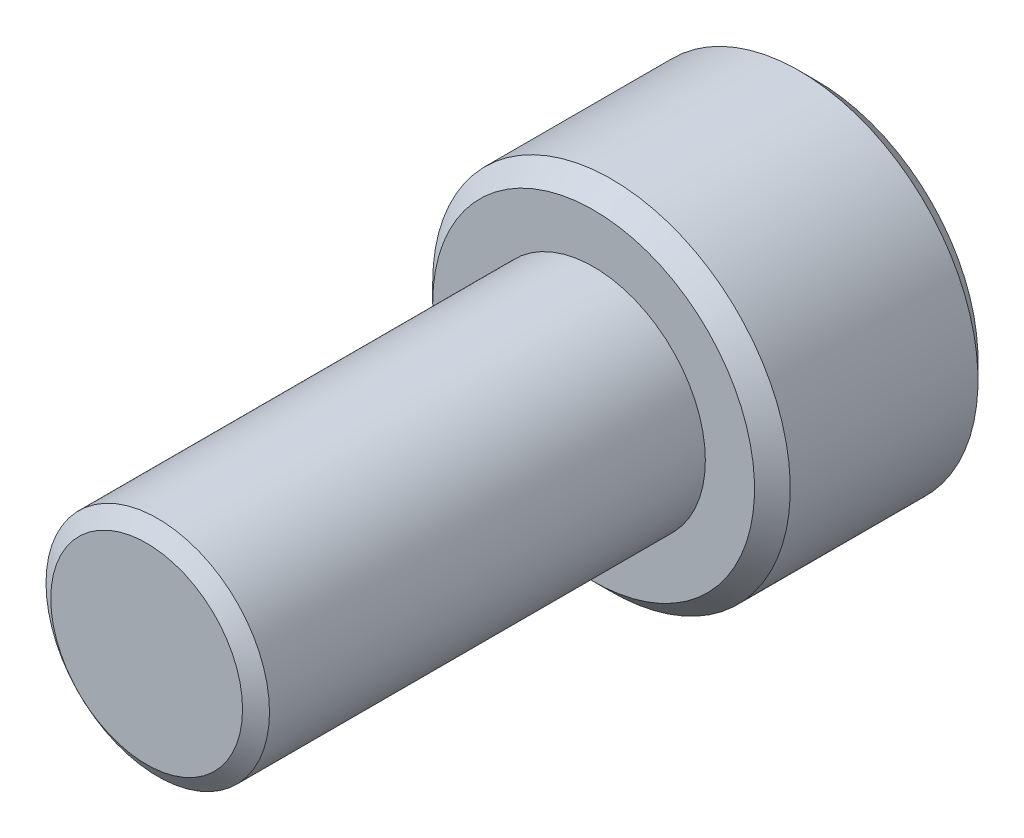
ISO-10303-21;
HEADER;
FILE_DESCRIPTION(('STEP AP214'),'2;1');
FILE_NAME('part.step','',(''),(''),'','','');
FILE_SCHEMA(('AUTOMOTIVE_DESIGN { 1 0 10303 214 1 1 1 1 }'));
ENDSEC;
DATA;
#1=APPLICATION_CONTEXT('core data for automotive mechanical design processes');
#2=APPLICATION_PROTOCOL_DEFINITION('international standard','automotive_design',2000,#1);
#3=PRODUCT_CONTEXT('',#1,'mechanical');
#4=PRODUCT('Part','Part','',(#3));
#5=PRODUCT_RELATED_PRODUCT_CATEGORY('part','',(#4));
#6=PRODUCT_DEFINITION_FORMATION('','',#4);
#7=PRODUCT_DEFINITION_CONTEXT('part definition',#1,'design');
#8=PRODUCT_DEFINITION('design','',#6,#7);
#9=PRODUCT_DEFINITION_SHAPE('','',#8);
#10=(LENGTH_UNIT() NAMED_UNIT(*) SI_UNIT(.MILLI.,.METRE.));
#11=(NAMED_UNIT(*) PLANE_ANGLE_UNIT() SI_UNIT($,.RADIAN.));
#12=(NAMED_UNIT(*) SI_UNIT($,.STERADIAN.) SOLID_ANGLE_UNIT());
#13=UNCERTAINTY_MEASURE_WITH_UNIT(LENGTH_MEASURE(1.E-05),#10,'distance_accuracy_value','');
#14=(GEOMETRIC_REPRESENTATION_CONTEXT(3) GLOBAL_UNCERTAINTY_ASSIGNED_CONTEXT((#13)) GLOBAL_UNIT_ASSIGNED_CONTEXT((#10,
#11,#12)) REPRESENTATION_CONTEXT('',''));
#15=CARTESIAN_POINT('',(0.,0.,0.));
#16=DIRECTION('',(0.,0.,1.));
#17=DIRECTION('',(1.,0.,0.));
#18=AXIS2_PLACEMENT_3D('',#15,#16,#17);
#19=CARTESIAN_POINT('',(0.,0.,-20.));
#20=DIRECTION('',(0.,0.,1.));
#21=DIRECTION('',(1.,0.,0.));
#22=AXIS2_PLACEMENT_3D('',#19,#20,#21);
#23=CYLINDRICAL_SURFACE('',#22,5.);
#24=CARTESIAN_POINT('',(0.,0.,-20.));
#25=DIRECTION('',(0.,0.,-1.));
#26=DIRECTION('',(-1.,0.,0.));
#27=AXIS2_PLACEMENT_3D('',#24,#25,#26);
#28=CIRCLE('',#27,5.);
#29=CARTESIAN_POINT('',(-5.,0.,-20.));
#30=VERTEX_POINT('',#29);
#31=EDGE_CURVE('E230',#30,#30,#28,.F.);
#32=ORIENTED_EDGE('',*,*,#31,.T.);
#33=EDGE_LOOP('',(#32));
#34=FACE_BOUND('',#33,.T.);
#35=CARTESIAN_POINT('',(0.,0.,-0.496211410611025));
#36=DIRECTION('',(0.,0.,1.));
#37=DIRECTION('',(1.,0.,0.));
#38=AXIS2_PLACEMENT_3D('',#35,#36,#37);
#39=CIRCLE('',#38,5.);
#40=CARTESIAN_POINT('',(5.,0.,-0.496211410611025));
#41=VERTEX_POINT('',#40);
#42=EDGE_CURVE('E115',#41,#41,#39,.T.);
#43=ORIENTED_EDGE('',*,*,#42,.F.);
#44=EDGE_LOOP('',(#43));
#45=FACE_BOUND('',#44,.T.);
#46=ADVANCED_FACE('F38',(#34,#45),#23,.T.);
#47=CARTESIAN_POINT('',(0.,0.,0.));
#48=DIRECTION('',(0.,0.,-1.));
#49=DIRECTION('',(-1.,0.,0.));
#50=AXIS2_PLACEMENT_3D('',#47,#48,#49);
#51=CONICAL_SURFACE('',#50,4.29133666301317,0.959931088596885);
#52=ORIENTED_EDGE('',*,*,#42,.T.);
#53=EDGE_LOOP('',(#52));
#54=FACE_BOUND('',#53,.T.);
#55=CARTESIAN_POINT('',(0.,0.,0.));
#56=DIRECTION('',(0.,0.,1.));
#57=DIRECTION('',(1.,0.,0.));
#58=AXIS2_PLACEMENT_3D('',#55,#56,#57);
#59=CIRCLE('',#58,4.29133666301317);
#60=CARTESIAN_POINT('',(4.29133666301317,0.,0.));
#61=VERTEX_POINT('',#60);
#62=EDGE_CURVE('E227',#61,#61,#59,.T.);
#63=ORIENTED_EDGE('',*,*,#62,.F.);
#64=EDGE_LOOP('',(#63));
#65=FACE_BOUND('',#64,.T.);
#66=ADVANCED_FACE('F210',(#54,#65),#51,.T.);
#67=CARTESIAN_POINT('',(0.,0.,0.));
#68=DIRECTION('',(0.,0.,1.));
#69=DIRECTION('',(1.,0.,0.));
#70=AXIS2_PLACEMENT_3D('',#67,#68,#69);
#71=PLANE('',#70);
#72=ORIENTED_EDGE('',*,*,#62,.T.);
#73=EDGE_LOOP('',(#72));
#74=FACE_BOUND('',#73,.T.);
#75=ADVANCED_FACE('F207',(#74),#71,.T.);
#76=CARTESIAN_POINT('',(0.,0.,-30.));
#77=DIRECTION('',(0.,0.,1.));
#78=DIRECTION('',(1.,0.,0.));
#79=AXIS2_PLACEMENT_3D('',#76,#77,#78);
#80=CYLINDRICAL_SURFACE('',#79,8.);
#81=CARTESIAN_POINT('',(0.,0.,-29.2));
#82=DIRECTION('',(0.,0.,-1.));
#83=DIRECTION('',(-1.,0.,0.));
#84=AXIS2_PLACEMENT_3D('',#81,#82,#83);
#85=CIRCLE('',#84,8.);
#86=CARTESIAN_POINT('',(-8.,0.,-29.2));
#87=VERTEX_POINT('',#86);
#88=EDGE_CURVE('E47',#87,#87,#85,.F.);
#89=ORIENTED_EDGE('',*,*,#88,.T.);
#90=EDGE_LOOP('',(#89));
#91=FACE_BOUND('',#90,.T.);
#92=CARTESIAN_POINT('',(0.,0.,-20.8));
#93=DIRECTION('',(0.,0.,-1.));
#94=DIRECTION('',(-1.,0.,0.));
#95=AXIS2_PLACEMENT_3D('',#92,#93,#94);
#96=CIRCLE('',#95,8.);
#97=CARTESIAN_POINT('',(-8.,0.,-20.8));
#98=VERTEX_POINT('',#97);
#99=EDGE_CURVE('E184',#98,#98,#96,.T.);
#100=ORIENTED_EDGE('',*,*,#99,.T.);
#101=EDGE_LOOP('',(#100));
#102=FACE_BOUND('',#101,.T.);
#103=ADVANCED_FACE('F191',(#91,#102),#80,.T.);
#104=CARTESIAN_POINT('',(0.,0.,-30.));
#105=DIRECTION('',(0.,0.,-1.));
#106=DIRECTION('',(-1.,0.,0.));
#107=AXIS2_PLACEMENT_3D('',#104,#105,#106);
#108=PLANE('',#107);
#109=CARTESIAN_POINT('',(0.,0.,-30.));
#110=DIRECTION('',(0.,0.,-1.));
#111=DIRECTION('',(-1.,0.,0.));
#112=AXIS2_PLACEMENT_3D('',#109,#110,#111);
#113=CIRCLE('',#112,7.2);
#114=CARTESIAN_POINT('',(-7.2,0.,-30.));
#115=VERTEX_POINT('',#114);
#116=EDGE_CURVE('E114',#115,#115,#113,.T.);
#117=ORIENTED_EDGE('',*,*,#116,.T.);
#118=EDGE_LOOP('',(#117));
#119=FACE_BOUND('',#118,.T.);
#120=CARTESIAN_POINT('',(0.,0.,-30.));
#121=DIRECTION('',(0.,0.,-1.));
#122=DIRECTION('',(-1.,0.,0.));
#123=AXIS2_PLACEMENT_3D('',#120,#121,#122);
#124=CIRCLE('',#123,4.618802153517);
#125=CARTESIAN_POINT('',(-4.,2.3094010767585,-30.));
#126=VERTEX_POINT('',#125);
#127=CARTESIAN_POINT('',(0.,4.618802153517,-30.));
#128=VERTEX_POINT('',#127);
#129=EDGE_CURVE('E93',#126,#128,#124,.T.);
#130=ORIENTED_EDGE('',*,*,#129,.F.);
#131=CARTESIAN_POINT('',(-4.,-2.3094010767585,-30.));
#132=VERTEX_POINT('',#131);
#133=EDGE_CURVE('E53',#132,#126,#124,.T.);
#134=ORIENTED_EDGE('',*,*,#133,.F.);
#135=CARTESIAN_POINT('',(0.,-4.61880215351701,-30.));
#136=VERTEX_POINT('',#135);
#137=EDGE_CURVE('E303',#136,#132,#124,.T.);
#138=ORIENTED_EDGE('',*,*,#137,.F.);
#139=CARTESIAN_POINT('',(4.,-2.3094010767585,-30.));
#140=VERTEX_POINT('',#139);
#141=EDGE_CURVE('E60',#140,#136,#124,.T.);
#142=ORIENTED_EDGE('',*,*,#141,.F.);
#143=CARTESIAN_POINT('',(4.,2.3094010767585,-30.));
#144=VERTEX_POINT('',#143);
#145=EDGE_CURVE('E138',#144,#140,#124,.T.);
#146=ORIENTED_EDGE('',*,*,#145,.F.);
#147=EDGE_CURVE('E103',#128,#144,#124,.T.);
#148=ORIENTED_EDGE('',*,*,#147,.F.);
#149=EDGE_LOOP('',(#130,#134,#138,#142,#146,#148));
#150=FACE_BOUND('',#149,.T.);
#151=ADVANCED_FACE('F137',(#119,#150),#108,.T.);
#152=CARTESIAN_POINT('',(0.,0.,-20.));
#153=DIRECTION('',(0.,0.,-1.));
#154=DIRECTION('',(-1.,0.,0.));
#155=AXIS2_PLACEMENT_3D('',#152,#153,#154);
#156=PLANE('',#155);
#157=CARTESIAN_POINT('',(0.,0.,-20.));
#158=DIRECTION('',(0.,0.,-1.));
#159=DIRECTION('',(-1.,0.,0.));
#160=AXIS2_PLACEMENT_3D('',#157,#158,#159);
#161=CIRCLE('',#160,7.2);
#162=CARTESIAN_POINT('',(-7.2,0.,-20.));
#163=VERTEX_POINT('',#162);
#164=EDGE_CURVE('E11',#163,#163,#161,.F.);
#165=ORIENTED_EDGE('',*,*,#164,.T.);
#166=EDGE_LOOP('',(#165));
#167=FACE_BOUND('',#166,.T.);
#168=ORIENTED_EDGE('',*,*,#31,.F.);
#169=EDGE_LOOP('',(#168));
#170=FACE_BOUND('',#169,.T.);
#171=ADVANCED_FACE('F200',(#167,#170),#156,.F.);
#172=CARTESIAN_POINT('',(0.,0.,-30.));
#173=DIRECTION('',(0.,0.,-1.));
#174=DIRECTION('',(-1.,0.,0.));
#175=AXIS2_PLACEMENT_3D('',#172,#173,#174);
#176=CONICAL_SURFACE('',#175,4.618802153517,0.78539816339745);
#177=ORIENTED_EDGE('',*,*,#147,.T.);
#178=CARTESIAN_POINT('',(-0.000199999999999718,4.61891762357084,-30.0001154743839));
#179=CARTESIAN_POINT('',(0.0685809847183837,4.57920690352856,-29.9604088559576));
#180=CARTESIAN_POINT('',(0.137888304896502,4.53919230356691,-29.9219204171131));
#181=CARTESIAN_POINT('',(0.277664036763594,4.45849274714727,-29.8477512237355));
#182=CARTESIAN_POINT('',(0.348133057578705,4.41780743901013,-29.8120720027316));
#183=CARTESIAN_POINT('',(0.562100081603904,4.29427352009148,-29.709500867651));
#184=CARTESIAN_POINT('',(0.707416589267747,4.21037499527406,-29.6475131110126));
#185=CARTESIAN_POINT('',(1.00040214981326,4.04121970302444,-29.5413558690094));
#186=CARTESIAN_POINT('',(1.14799719663765,3.95600566300932,-29.4969190554534));
#187=CARTESIAN_POINT('',(1.44644641508887,3.78369592639708,-29.4284489821294));
#188=CARTESIAN_POINT('',(1.59729144640344,3.69660550696169,-29.4043646378613));
#189=CARTESIAN_POINT('',(1.85726690511356,3.54650860589271,-29.3826348808605));
#190=CARTESIAN_POINT('',(1.96606238220553,3.48369550790705,-29.3794189146409));
#191=CARTESIAN_POINT('',(2.18347675426333,3.35817126167378,-29.384840058225));
#192=CARTESIAN_POINT('',(2.29209557396636,3.29546015687918,-29.3934813231718));
#193=CARTESIAN_POINT('',(2.50830402737816,3.1706321481008,-29.4221240384964));
#194=CARTESIAN_POINT('',(2.61589237292034,3.10851598784036,-29.4421381945513));
#195=CARTESIAN_POINT('',(2.82922129322135,2.98535047827864,-29.4924341573647));
#196=CARTESIAN_POINT('',(2.93496200899965,2.92430104755974,-29.5227151768784));
#197=CARTESIAN_POINT('',(3.12267722089176,2.81592361944283,-29.5850152526942));
#198=CARTESIAN_POINT('',(3.20506731843131,2.76835567444982,-29.6153962798601));
#199=CARTESIAN_POINT('',(3.3683684620413,2.67407371522762,-29.6810544645603));
#200=CARTESIAN_POINT('',(3.44927946303276,2.62735972702479,-29.7163317710398));
#201=CARTESIAN_POINT('',(3.60936749601013,2.53493285809127,-29.7909916870209));
#202=CARTESIAN_POINT('',(3.68854908118624,2.48921734857499,-29.8303613870036));
#203=CARTESIAN_POINT('',(3.84544590098815,2.39863292742735,-29.9126891081433));
#204=CARTESIAN_POINT('',(3.92316199986076,2.35376351682288,-29.9556449278019));
#205=CARTESIAN_POINT('',(4.0002,2.30928560670467,-30.0001154743839));
#206=B_SPLINE_CURVE_WITH_KNOTS('',3,(#178,#179,#180,#181,#182,#183,#184,#185,#186,#187,#188,
#189,#190,#191,#192,#193,#194,#195,#196,#197,#198,#199,#200,#201,#202,#203,#204,#205),
.UNSPECIFIED.,.F.,.F.,(4,2,2,2,2,2,2,2,2,2,2,2,2,4),(0.,0.266361961703663,0.532868334400111,
1.06875865685462,1.59613884594051,2.1221913505558,2.49866160599658,2.87526382203494,
3.25228760372076,3.62928248242857,3.92874944437161,4.22822551811345,4.52678401907573,
4.82516056577921),.UNSPECIFIED.);
#207=EDGE_CURVE('E108',#128,#144,#206,.T.);
#208=ORIENTED_EDGE('',*,*,#207,.F.);
#209=EDGE_LOOP('',(#177,#208));
#210=FACE_BOUND('',#209,.T.);
#211=ADVANCED_FACE('F109',(#210),#176,.F.);
#212=ORIENTED_EDGE('',*,*,#145,.T.);
#213=CARTESIAN_POINT('',(4.,-4.60588834585846,-31.4815427100554));
#214=CARTESIAN_POINT('',(4.,-4.49374002821923,-31.3968876312289));
#215=CARTESIAN_POINT('',(4.,-4.38096379821011,-31.3130508557852));
#216=CARTESIAN_POINT('',(4.,-4.1539078224607,-31.1473802935294));
#217=CARTESIAN_POINT('',(4.,-4.03962770639667,-31.0655470148149));
#218=CARTESIAN_POINT('',(4.,-3.80848031083369,-30.9036679969616));
#219=CARTESIAN_POINT('',(4.,-3.69159984616663,-30.8236410211269));
#220=CARTESIAN_POINT('',(4.,-3.45585499794049,-30.6665741495931));
#221=CARTESIAN_POINT('',(4.,-3.33699075539683,-30.5895340428573));
#222=CARTESIAN_POINT('',(4.,-3.09010281107529,-30.4348060364959));
#223=CARTESIAN_POINT('',(4.,-2.96194389824947,-30.3573327874458));
#224=CARTESIAN_POINT('',(4.,-2.70263458682281,-30.207483494942));
#225=CARTESIAN_POINT('',(4.,-2.57148371860612,-30.1351082590594));
#226=CARTESIAN_POINT('',(4.,-2.30620269588561,-29.9970165999514));
#227=CARTESIAN_POINT('',(4.,-2.1720828143263,-29.931280596426));
#228=CARTESIAN_POINT('',(4.,-1.90018524463694,-29.8079389856064));
#229=CARTESIAN_POINT('',(4.,-1.76240924651062,-29.750329696999));
#230=CARTESIAN_POINT('',(4.,-1.49423245423071,-29.6495195910183));
#231=CARTESIAN_POINT('',(4.,-1.36413038006124,-29.6055323527125));
#232=CARTESIAN_POINT('',(4.,-1.10079389466481,-29.5279953825842));
#233=CARTESIAN_POINT('',(4.,-0.967559268328321,-29.49444636981));
#234=CARTESIAN_POINT('',(4.,-0.700969263713321,-29.4400959937613));
#235=CARTESIAN_POINT('',(4.,-0.567659151489366,-29.4190762199428));
#236=CARTESIAN_POINT('',(4.,-0.299613801548666,-29.3901923046075));
#237=CARTESIAN_POINT('',(4.,-0.164878812816916,-29.3823259016629));
#238=CARTESIAN_POINT('',(4.,0.0998110426161468,-29.3803329421123));
#239=CARTESIAN_POINT('',(4.,0.229762408781349,-29.3857193675581));
#240=CARTESIAN_POINT('',(4.,0.488552004486205,-29.4088600629805));
#241=CARTESIAN_POINT('',(4.,0.617390124658868,-29.4266155344344));
#242=CARTESIAN_POINT('',(4.,0.875199003234475,-29.4738276474748));
#243=CARTESIAN_POINT('',(4.,1.00413270849071,-29.5034834133105));
#244=CARTESIAN_POINT('',(4.,1.25919079381534,-29.5729145209428));
#245=CARTESIAN_POINT('',(4.,1.38531540799082,-29.6126890159958));
#246=CARTESIAN_POINT('',(4.,1.64617719318931,-29.7048119901029));
#247=CARTESIAN_POINT('',(4.,1.78061927932313,-29.7579876430135));
#248=CARTESIAN_POINT('',(4.,2.046011294482,-29.8725026332475));
#249=CARTESIAN_POINT('',(4.,2.17695956238624,-29.9338457735747));
#250=CARTESIAN_POINT('',(4.,2.4360038929671,-30.0632362545334));
#251=CARTESIAN_POINT('',(4.,2.5640893557596,-30.1313046457109));
#252=CARTESIAN_POINT('',(4.,2.81731270115426,-30.2726411351195));
#253=CARTESIAN_POINT('',(4.,2.94245104834804,-30.345908406377));
#254=CARTESIAN_POINT('',(4.,3.18400809183147,-30.4928694369693));
#255=CARTESIAN_POINT('',(4.,3.30055078216151,-30.5663604651561));
#256=CARTESIAN_POINT('',(4.,3.5316354061622,-30.7164329441833));
#257=CARTESIAN_POINT('',(4.,3.64617718734198,-30.7930146291055));
#258=CARTESIAN_POINT('',(4.,3.87259303922058,-30.9480834223493));
#259=CARTESIAN_POINT('',(4.,3.98448122200407,-31.0265499994366));
#260=CARTESIAN_POINT('',(4.,4.20672850859699,-31.1855582141516));
#261=CARTESIAN_POINT('',(4.,4.31708802443965,-31.2660992752063));
#262=CARTESIAN_POINT('',(4.,4.42680741385317,-31.3474884762919));
#263=B_SPLINE_CURVE_WITH_KNOTS('',3,(#213,#214,#215,#216,#217,#218,#219,#220,#221,#222,#223,
#224,#225,#226,#227,#228,#229,#230,#231,#232,#233,#234,#235,#236,#237,#238,#239,#240,#241,#242,
#243,#244,#245,#246,#247,#248,#249,#250,#251,#252,#253,#254,#255,#256,#257,#258,#259,#260,#261,
#262),.UNSPECIFIED.,.F.,.F.,(4,2,2,2,2,2,2,2,2,2,2,2,2,2,2,2,2,2,2,2,2,2,2,2,4),(0.,
0.421545463953782,0.84319674931718,1.26811510924698,1.69300339174034,2.14217661823513,
2.59142083852277,3.03929889601296,3.48697341360786,3.8986221993791,4.31029933574147,
4.71457260722766,5.11877636581776,5.50834966824608,5.89796081747125,6.29438282622667,
6.69077167296899,7.12416312979248,7.55775709580142,7.99275404267762,8.42768195006618,
8.84096248534662,9.2542743808521,9.66422889385948,10.0740706699154),.UNSPECIFIED.);
#264=EDGE_CURVE('E102',#144,#140,#263,.F.);
#265=ORIENTED_EDGE('',*,*,#264,.F.);
#266=EDGE_LOOP('',(#212,#265));
#267=FACE_BOUND('',#266,.T.);
#268=ADVANCED_FACE('F314',(#267),#176,.F.);
#269=ORIENTED_EDGE('',*,*,#141,.T.);
#270=CARTESIAN_POINT('',(4.0002,-2.30928560670467,-30.0001154743839));
#271=CARTESIAN_POINT('',(3.93141901528162,-2.34899632674695,-29.9604088559576));
#272=CARTESIAN_POINT('',(3.8621116951035,-2.3890109267086,-29.9219204171131));
#273=CARTESIAN_POINT('',(3.72233596323641,-2.46971048312824,-29.8477512237355));
#274=CARTESIAN_POINT('',(3.65186694242129,-2.51039579126538,-29.8120720027316));
#275=CARTESIAN_POINT('',(3.4378999183961,-2.63392971018403,-29.709500867651));
#276=CARTESIAN_POINT('',(3.29258341073225,-2.71782823500144,-29.6475131110126));
#277=CARTESIAN_POINT('',(2.99959785018675,-2.88698352725107,-29.5413558690094));
#278=CARTESIAN_POINT('',(2.85200280336236,-2.97219756726618,-29.4969190554534));
#279=CARTESIAN_POINT('',(2.55355358491113,-3.14450730387843,-29.4284489821294));
#280=CARTESIAN_POINT('',(2.40270855359656,-3.23159772331381,-29.4043646378613));
#281=CARTESIAN_POINT('',(2.14273309488644,-3.3816946243828,-29.3826348808605));
#282=CARTESIAN_POINT('',(2.03393761779447,-3.44450772236846,-29.3794189146409));
#283=CARTESIAN_POINT('',(1.81652324573667,-3.57003196860173,-29.384840058225));
#284=CARTESIAN_POINT('',(1.70790442603364,-3.63274307339633,-29.3934813231718));
#285=CARTESIAN_POINT('',(1.49169597262184,-3.7575710821747,-29.4221240384964));
#286=CARTESIAN_POINT('',(1.38410762707967,-3.81968724243515,-29.4421381945513));
#287=CARTESIAN_POINT('',(1.17077870677865,-3.94285275199687,-29.4924341573647));
#288=CARTESIAN_POINT('',(1.06503799100036,-4.00390218271577,-29.5227151768784));
#289=CARTESIAN_POINT('',(0.877322779108238,-4.11227961083267,-29.5850152526942));
#290=CARTESIAN_POINT('',(0.79493268156869,-4.15984755582569,-29.6153962798601));
#291=CARTESIAN_POINT('',(0.631631537958706,-4.25412951504789,-29.6810544645603));
#292=CARTESIAN_POINT('',(0.550720536967238,-4.30084350325072,-29.7163317710398));
#293=CARTESIAN_POINT('',(0.390632503989867,-4.39327037218424,-29.7909916870209));
#294=CARTESIAN_POINT('',(0.311450918813762,-4.43898588170052,-29.8303613870036));
#295=CARTESIAN_POINT('',(0.154554099011845,-4.52957030284816,-29.9126891081433));
#296=CARTESIAN_POINT('',(0.0768380001392352,-4.57443971345263,-29.9556449278019));
#297=CARTESIAN_POINT('',(-0.000199999999999255,-4.61891762357084,-30.0001154743839));
#298=B_SPLINE_CURVE_WITH_KNOTS('',3,(#270,#271,#272,#273,#274,#275,#276,#277,#278,#279,#280,
#281,#282,#283,#284,#285,#286,#287,#288,#289,#290,#291,#292,#293,#294,#295,#296,#297),
.UNSPECIFIED.,.F.,.F.,(4,2,2,2,2,2,2,2,2,2,2,2,2,4),(0.,0.266361961703663,0.53286833440011,
1.06875865685462,1.5961388459405,2.1221913505558,2.49866160599658,2.87526382203494,
3.25228760372076,3.62928248242857,3.9287494443716,4.22822551811345,4.52678401907573,
4.82516056577921),.UNSPECIFIED.);
#299=EDGE_CURVE('E151',#140,#136,#298,.T.);
#300=ORIENTED_EDGE('',*,*,#299,.F.);
#301=EDGE_LOOP('',(#269,#300));
#302=FACE_BOUND('',#301,.T.);
#303=ADVANCED_FACE('F311',(#302),#176,.F.);
#304=ORIENTED_EDGE('',*,*,#137,.T.);
#305=CARTESIAN_POINT('',(0.000200000000000893,-4.61891762357084,-30.0001154743839));
#306=CARTESIAN_POINT('',(-0.0685809847183829,-4.57920690352856,-29.9604088559576));
#307=CARTESIAN_POINT('',(-0.137888304896501,-4.53919230356691,-29.9219204171131));
#308=CARTESIAN_POINT('',(-0.277664036763594,-4.45849274714727,-29.8477512237355));
#309=CARTESIAN_POINT('',(-0.348133057578704,-4.41780743901013,-29.8120720027316));
#310=CARTESIAN_POINT('',(-0.562100081603902,-4.29427352009148,-29.709500867651));
#311=CARTESIAN_POINT('',(-0.707416589267745,-4.21037499527407,-29.6475131110126));
#312=CARTESIAN_POINT('',(-1.00040214981325,-4.04121970302444,-29.5413558690094));
#313=CARTESIAN_POINT('',(-1.14799719663764,-3.95600566300933,-29.4969190554534));
#314=CARTESIAN_POINT('',(-1.44644641508887,-3.78369592639708,-29.4284489821294));
#315=CARTESIAN_POINT('',(-1.59729144640344,-3.69660550696169,-29.4043646378613));
#316=CARTESIAN_POINT('',(-1.85726690511356,-3.54650860589271,-29.3826348808605));
#317=CARTESIAN_POINT('',(-1.96606238220553,-3.48369550790705,-29.3794189146409));
#318=CARTESIAN_POINT('',(-2.18347675426333,-3.35817126167378,-29.384840058225));
#319=CARTESIAN_POINT('',(-2.29209557396636,-3.29546015687918,-29.3934813231718));
#320=CARTESIAN_POINT('',(-2.50830402737816,-3.1706321481008,-29.4221240384964));
#321=CARTESIAN_POINT('',(-2.61589237292034,-3.10851598784036,-29.4421381945513));
#322=CARTESIAN_POINT('',(-2.82922129322135,-2.98535047827864,-29.4924341573647));
#323=CARTESIAN_POINT('',(-2.93496200899965,-2.92430104755974,-29.5227151768784));
#324=CARTESIAN_POINT('',(-3.12267722089176,-2.81592361944283,-29.5850152526942));
#325=CARTESIAN_POINT('',(-3.20506731843131,-2.76835567444982,-29.6153962798601));
#326=CARTESIAN_POINT('',(-3.3683684620413,-2.67407371522762,-29.6810544645603));
#327=CARTESIAN_POINT('',(-3.44927946303276,-2.62735972702479,-29.7163317710398));
#328=CARTESIAN_POINT('',(-3.60936749601013,-2.53493285809127,-29.7909916870209));
#329=CARTESIAN_POINT('',(-3.68854908118624,-2.48921734857498,-29.8303613870036));
#330=CARTESIAN_POINT('',(-3.84544590098816,-2.39863292742735,-29.9126891081433));
#331=CARTESIAN_POINT('',(-3.92316199986077,-2.35376351682288,-29.955644927802));
#332=CARTESIAN_POINT('',(-4.0002,-2.30928560670467,-30.0001154743839));
#333=B_SPLINE_CURVE_WITH_KNOTS('',3,(#305,#306,#307,#308,#309,#310,#311,#312,#313,#314,#315,
#316,#317,#318,#319,#320,#321,#322,#323,#324,#325,#326,#327,#328,#329,#330,#331,#332),
.UNSPECIFIED.,.F.,.F.,(4,2,2,2,2,2,2,2,2,2,2,2,2,4),(0.,0.266361961703664,0.532868334400111,
1.06875865685462,1.5961388459405,2.1221913505558,2.49866160599658,2.87526382203494,
3.25228760372076,3.62928248242857,3.92874944437161,4.22822551811345,4.52678401907574,
4.82516056577921),.UNSPECIFIED.);
#334=EDGE_CURVE('E280',#136,#132,#333,.T.);
#335=ORIENTED_EDGE('',*,*,#334,.F.);
#336=EDGE_LOOP('',(#304,#335));
#337=FACE_BOUND('',#336,.T.);
#338=ADVANCED_FACE('F308',(#337),#176,.F.);
#339=ORIENTED_EDGE('',*,*,#133,.T.);
#340=CARTESIAN_POINT('',(-4.,-4.6058883465286,-31.4815427105614));
#341=CARTESIAN_POINT('',(-4.,-4.49374002887056,-31.3968876317154));
#342=CARTESIAN_POINT('',(-4.,-4.38096379884258,-31.3130508562522));
#343=CARTESIAN_POINT('',(-4.,-4.15390782305526,-31.1473802939577));
#344=CARTESIAN_POINT('',(-4.,-4.03962770697217,-31.0655470152237));
#345=CARTESIAN_POINT('',(-4.,-3.80848031137046,-30.9036679973316));
#346=CARTESIAN_POINT('',(-4.,-3.69159984668369,-30.8236410214775));
#347=CARTESIAN_POINT('',(-4.,-3.4558549984178,-30.666574149905));
#348=CARTESIAN_POINT('',(-4.,-3.33699075585408,-30.5895340431501));
#349=CARTESIAN_POINT('',(-4.,-3.0901028114893,-30.4348060367488));
#350=CARTESIAN_POINT('',(-4.,-2.96194389864023,-30.357332787678));
#351=CARTESIAN_POINT('',(-4.,-2.70263458716623,-30.207483495134));
#352=CARTESIAN_POINT('',(-4.,-2.57148371892545,-30.1351082592317));
#353=CARTESIAN_POINT('',(-4.,-2.30620269615589,-29.997016600086));
#354=CARTESIAN_POINT('',(-4.,-2.17208281457164,-29.9312805965425));
#355=CARTESIAN_POINT('',(-4.,-1.90018524483104,-29.8079389856892));
#356=CARTESIAN_POINT('',(-4.,-1.76240924667844,-29.750329697066));
#357=CARTESIAN_POINT('',(-4.,-1.49423245438718,-29.6495195910735));
#358=CARTESIAN_POINT('',(-4.,-1.36413038023378,-29.6055323527688));
#359=CARTESIAN_POINT('',(-4.,-1.10079389487004,-29.5279953826392));
#360=CARTESIAN_POINT('',(-4.,-0.967559268550154,-29.4944463698627));
#361=CARTESIAN_POINT('',(-4.,-0.70096926396781,-29.4400959938058));
#362=CARTESIAN_POINT('',(-4.,-0.567659151759903,-29.4190762199813));
#363=CARTESIAN_POINT('',(-4.,-0.299613801850762,-29.3901923046306));
#364=CARTESIAN_POINT('',(-4.,-0.164878813134523,-29.3823259016765));
#365=CARTESIAN_POINT('',(-4.,0.0998110422699212,-29.3803329421041));
#366=CARTESIAN_POINT('',(-4.,0.229762408421976,-29.3857193675379));
#367=CARTESIAN_POINT('',(-4.,0.488552004101853,-29.4088600629343));
#368=CARTESIAN_POINT('',(-4.,0.617390124262684,-29.4266155343742));
#369=CARTESIAN_POINT('',(-4.,0.875199002814934,-29.4738276473854));
#370=CARTESIAN_POINT('',(-4.,1.00413270805968,-29.5034834132057));
#371=CARTESIAN_POINT('',(-4.,1.25919079336244,-29.5729145208069));
#372=CARTESIAN_POINT('',(-4.,1.38531540752754,-29.6126890158442));
#373=CARTESIAN_POINT('',(-4.,1.64617719267059,-29.7048119899065));
#374=CARTESIAN_POINT('',(-4.,1.78061927876033,-29.7579876427854));
#375=CARTESIAN_POINT('',(-4.,2.0460112938333,-29.8725026329529));
#376=CARTESIAN_POINT('',(-4.,2.17695956169572,-29.9338457732451));
#377=CARTESIAN_POINT('',(-4.,2.43600389219443,-30.063236254132));
#378=CARTESIAN_POINT('',(-4.,2.56408935494662,-30.1313046452726));
#379=CARTESIAN_POINT('',(-4.,2.81731270026197,-30.2726411346061));
#380=CARTESIAN_POINT('',(-4.,2.94245104741675,-30.3459084058254));
#381=CARTESIAN_POINT('',(-4.,3.18400809082929,-30.4928694363453));
#382=CARTESIAN_POINT('',(-4.,3.30055078112731,-30.566360464498));
#383=CARTESIAN_POINT('',(-4.,3.53163540506442,-30.7164329434568));
#384=CARTESIAN_POINT('',(-4.,3.64617718621264,-30.7930146283448));
#385=CARTESIAN_POINT('',(-4.,3.87259303802889,-30.9480834215204));
#386=CARTESIAN_POINT('',(-4.,3.98448122078158,-31.0265499985739));
#387=CARTESIAN_POINT('',(-4.,4.20672850731309,-31.1855582132212));
#388=CARTESIAN_POINT('',(-4.,4.31708802312514,-31.266099274242));
#389=CARTESIAN_POINT('',(-4.,4.42680741250811,-31.3474884752939));
#390=B_SPLINE_CURVE_WITH_KNOTS('',3,(#340,#341,#342,#343,#344,#345,#346,#347,#348,#349,#350,
#351,#352,#353,#354,#355,#356,#357,#358,#359,#360,#361,#362,#363,#364,#365,#366,#367,#368,#369,
#370,#371,#372,#373,#374,#375,#376,#377,#378,#379,#380,#381,#382,#383,#384,#385,#386,#387,#388,
#389),.UNSPECIFIED.,.F.,.F.,(4,2,2,2,2,2,2,2,2,2,2,2,2,2,2,2,2,2,2,2,2,2,2,2,4),(0.,
0.421545464034018,0.843196749477674,1.26811510948924,1.69300339206436,2.14217661865083,
2.5914208390302,3.03929889661137,3.48697341429709,3.89862220002184,4.3102993363378,
4.71457260777947,5.11877636632505,5.50834966871263,5.89796081789702,6.29438282660854,
6.69077167330698,7.12416312997274,7.55775709582377,7.99275404254115,8.42768194977097,
8.84096248491557,9.25427438028522,9.66422889315859,10.0740706690805),.UNSPECIFIED.);
#391=EDGE_CURVE('E126',#132,#126,#390,.T.);
#392=ORIENTED_EDGE('',*,*,#391,.F.);
#393=EDGE_LOOP('',(#339,#392));
#394=FACE_BOUND('',#393,.T.);
#395=ADVANCED_FACE('F323',(#394),#176,.F.);
#396=ORIENTED_EDGE('',*,*,#129,.T.);
#397=CARTESIAN_POINT('',(-4.0002,2.30928560670467,-30.0001154743839));
#398=CARTESIAN_POINT('',(-3.93141901528162,2.34899632674695,-29.9604088559576));
#399=CARTESIAN_POINT('',(-3.8621116951035,2.3890109267086,-29.9219204171131));
#400=CARTESIAN_POINT('',(-3.7223359632364,2.46971048312824,-29.8477512237355));
#401=CARTESIAN_POINT('',(-3.65186694242129,2.51039579126538,-29.8120720027316));
#402=CARTESIAN_POINT('',(-3.4378999183961,2.63392971018403,-29.709500867651));
#403=CARTESIAN_POINT('',(-3.29258341073225,2.71782823500144,-29.6475131110126));
#404=CARTESIAN_POINT('',(-2.99959785018674,2.88698352725107,-29.5413558690094));
#405=CARTESIAN_POINT('',(-2.85200280336235,2.97219756726618,-29.4969190554534));
#406=CARTESIAN_POINT('',(-2.55355358491113,3.14450730387843,-29.4284489821294));
#407=CARTESIAN_POINT('',(-2.40270855359656,3.23159772331382,-29.4043646378613));
#408=CARTESIAN_POINT('',(-2.14273309488644,3.3816946243828,-29.3826348808605));
#409=CARTESIAN_POINT('',(-2.03393761779447,3.44450772236846,-29.3794189146409));
#410=CARTESIAN_POINT('',(-1.81652324573667,3.57003196860173,-29.384840058225));
#411=CARTESIAN_POINT('',(-1.70790442603364,3.63274307339633,-29.3934813231718));
#412=CARTESIAN_POINT('',(-1.49169597262184,3.75757108217471,-29.4221240384964));
#413=CARTESIAN_POINT('',(-1.38410762707966,3.81968724243515,-29.4421381945513));
#414=CARTESIAN_POINT('',(-1.17077870677865,3.94285275199687,-29.4924341573647));
#415=CARTESIAN_POINT('',(-1.06503799100035,4.00390218271577,-29.5227151768784));
#416=CARTESIAN_POINT('',(-0.877322779108235,4.11227961083268,-29.5850152526942));
#417=CARTESIAN_POINT('',(-0.794932681568687,4.15984755582569,-29.6153962798601));
#418=CARTESIAN_POINT('',(-0.631631537958703,4.25412951504789,-29.6810544645603));
#419=CARTESIAN_POINT('',(-0.550720536967235,4.30084350325072,-29.7163317710398));
#420=CARTESIAN_POINT('',(-0.390632503989864,4.39327037218424,-29.7909916870209));
#421=CARTESIAN_POINT('',(-0.311450918813759,4.43898588170052,-29.8303613870036));
#422=CARTESIAN_POINT('',(-0.154554099011843,4.52957030284816,-29.9126891081433));
#423=CARTESIAN_POINT('',(-0.0768380001392341,4.57443971345263,-29.955644927802));
#424=CARTESIAN_POINT('',(0.000200000000000567,4.61891762357084,-30.0001154743839));
#425=B_SPLINE_CURVE_WITH_KNOTS('',3,(#397,#398,#399,#400,#401,#402,#403,#404,#405,#406,#407,
#408,#409,#410,#411,#412,#413,#414,#415,#416,#417,#418,#419,#420,#421,#422,#423,#424),
.UNSPECIFIED.,.F.,.F.,(4,2,2,2,2,2,2,2,2,2,2,2,2,4),(0.,0.266361961703664,0.532868334400111,
1.06875865685462,1.59613884594051,2.1221913505558,2.49866160599658,2.87526382203494,
3.25228760372077,3.62928248242858,3.92874944437161,4.22822551811345,4.52678401907573,
4.82516056577921),.UNSPECIFIED.);
#426=EDGE_CURVE('E97',#126,#128,#425,.T.);
#427=ORIENTED_EDGE('',*,*,#426,.F.);
#428=EDGE_LOOP('',(#396,#427));
#429=FACE_BOUND('',#428,.T.);
#430=ADVANCED_FACE('F95',(#429),#176,.F.);
#431=CARTESIAN_POINT('',(4.,6.92820323027551,-24.));
#432=DIRECTION('',(0.,0.,-1.));
#433=DIRECTION('',(-1.,0.,0.));
#434=AXIS2_PLACEMENT_3D('',#431,#432,#433);
#435=PLANE('',#434);
#436=DIRECTION('',(0.866025403784439,0.5,0.));
#437=VECTOR('',#436,1.);
#438=CARTESIAN_POINT('',(-4.,2.3094010767585,-24.));
#439=LINE('',#438,#437);
#440=CARTESIAN_POINT('',(-4.,2.3094010767585,-24.));
#441=VERTEX_POINT('',#440);
#442=CARTESIAN_POINT('',(0.,4.618802153517,-24.));
#443=VERTEX_POINT('',#442);
#444=EDGE_CURVE('E125',#441,#443,#439,.T.);
#445=ORIENTED_EDGE('',*,*,#444,.T.);
#446=DIRECTION('',(0.866025403784439,-0.5,0.));
#447=VECTOR('',#446,1.);
#448=CARTESIAN_POINT('',(0.,4.618802153517,-24.));
#449=LINE('',#448,#447);
#450=CARTESIAN_POINT('',(4.,2.3094010767585,-24.));
#451=VERTEX_POINT('',#450);
#452=EDGE_CURVE('E130',#443,#451,#449,.T.);
#453=ORIENTED_EDGE('',*,*,#452,.T.);
#454=DIRECTION('',(0.,-1.,0.));
#455=VECTOR('',#454,1.);
#456=CARTESIAN_POINT('',(4.,2.3094010767585,-24.));
#457=LINE('',#456,#455);
#458=CARTESIAN_POINT('',(4.,-2.3094010767585,-24.));
#459=VERTEX_POINT('',#458);
#460=EDGE_CURVE('E262',#451,#459,#457,.T.);
#461=ORIENTED_EDGE('',*,*,#460,.T.);
#462=DIRECTION('',(-0.866025403784439,-0.5,0.));
#463=VECTOR('',#462,1.);
#464=CARTESIAN_POINT('',(4.,-2.3094010767585,-24.));
#465=LINE('',#464,#463);
#466=CARTESIAN_POINT('',(0.,-4.61880215351701,-24.));
#467=VERTEX_POINT('',#466);
#468=EDGE_CURVE('E258',#459,#467,#465,.T.);
#469=ORIENTED_EDGE('',*,*,#468,.T.);
#470=DIRECTION('',(-0.866025403784439,0.5,0.));
#471=VECTOR('',#470,1.);
#472=CARTESIAN_POINT('',(0.,-4.61880215351701,-24.));
#473=LINE('',#472,#471);
#474=CARTESIAN_POINT('',(-4.,-2.3094010767585,-24.));
#475=VERTEX_POINT('',#474);
#476=EDGE_CURVE('E254',#467,#475,#473,.T.);
#477=ORIENTED_EDGE('',*,*,#476,.T.);
#478=DIRECTION('',(0.,1.,0.));
#479=VECTOR('',#478,1.);
#480=CARTESIAN_POINT('',(-4.,-2.3094010767585,-24.));
#481=LINE('',#480,#479);
#482=EDGE_CURVE('E134',#475,#441,#481,.T.);
#483=ORIENTED_EDGE('',*,*,#482,.T.);
#484=EDGE_LOOP('',(#445,#453,#461,#469,#477,#483));
#485=FACE_BOUND('',#484,.T.);
#486=ADVANCED_FACE('F171',(#485),#435,.T.);
#487=CARTESIAN_POINT('',(0.,4.618802153517,-24.));
#488=DIRECTION('',(0.5,0.866025403784439,0.));
#489=DIRECTION('',(-0.866025403784439,0.5,0.));
#490=AXIS2_PLACEMENT_3D('',#487,#488,#489);
#491=PLANE('',#490);
#492=DIRECTION('',(0.,0.,-1.));
#493=VECTOR('',#492,1.);
#494=CARTESIAN_POINT('',(0.,4.618802153517,-24.));
#495=LINE('',#494,#493);
#496=EDGE_CURVE('E121',#443,#128,#495,.T.);
#497=ORIENTED_EDGE('',*,*,#496,.T.);
#498=ORIENTED_EDGE('',*,*,#207,.T.);
#499=DIRECTION('',(0.,0.,-1.));
#500=VECTOR('',#499,1.);
#501=CARTESIAN_POINT('',(4.,2.3094010767585,-24.));
#502=LINE('',#501,#500);
#503=EDGE_CURVE('E133',#451,#144,#502,.T.);
#504=ORIENTED_EDGE('',*,*,#503,.F.);
#505=ORIENTED_EDGE('',*,*,#452,.F.);
#506=EDGE_LOOP('',(#497,#498,#504,#505));
#507=FACE_BOUND('',#506,.T.);
#508=ADVANCED_FACE('F128',(#507),#491,.F.);
#509=CARTESIAN_POINT('',(4.,2.3094010767585,-24.));
#510=DIRECTION('',(1.,0.,0.));
#511=DIRECTION('',(0.,0.,-1.));
#512=AXIS2_PLACEMENT_3D('',#509,#510,#511);
#513=PLANE('',#512);
#514=ORIENTED_EDGE('',*,*,#503,.T.);
#515=ORIENTED_EDGE('',*,*,#264,.T.);
#516=DIRECTION('',(0.,0.,-1.));
#517=VECTOR('',#516,1.);
#518=CARTESIAN_POINT('',(4.,-2.3094010767585,-24.));
#519=LINE('',#518,#517);
#520=EDGE_CURVE('E238',#459,#140,#519,.T.);
#521=ORIENTED_EDGE('',*,*,#520,.F.);
#522=ORIENTED_EDGE('',*,*,#460,.F.);
#523=EDGE_LOOP('',(#514,#515,#521,#522));
#524=FACE_BOUND('',#523,.T.);
#525=ADVANCED_FACE('F160',(#524),#513,.F.);
#526=CARTESIAN_POINT('',(4.,-2.3094010767585,-24.));
#527=DIRECTION('',(0.5,-0.866025403784439,0.));
#528=DIRECTION('',(0.866025403784439,0.5,0.));
#529=AXIS2_PLACEMENT_3D('',#526,#527,#528);
#530=PLANE('',#529);
#531=ORIENTED_EDGE('',*,*,#520,.T.);
#532=ORIENTED_EDGE('',*,*,#299,.T.);
#533=DIRECTION('',(0.,0.,-1.));
#534=VECTOR('',#533,1.);
#535=CARTESIAN_POINT('',(0.,-4.61880215351701,-24.));
#536=LINE('',#535,#534);
#537=EDGE_CURVE('E242',#467,#136,#536,.T.);
#538=ORIENTED_EDGE('',*,*,#537,.F.);
#539=ORIENTED_EDGE('',*,*,#468,.F.);
#540=EDGE_LOOP('',(#531,#532,#538,#539));
#541=FACE_BOUND('',#540,.T.);
#542=ADVANCED_FACE('F164',(#541),#530,.F.);
#543=CARTESIAN_POINT('',(0.,-4.61880215351701,-24.));
#544=DIRECTION('',(-0.5,-0.866025403784439,0.));
#545=DIRECTION('',(0.866025403784439,-0.5,0.));
#546=AXIS2_PLACEMENT_3D('',#543,#544,#545);
#547=PLANE('',#546);
#548=ORIENTED_EDGE('',*,*,#537,.T.);
#549=ORIENTED_EDGE('',*,*,#334,.T.);
#550=DIRECTION('',(0.,0.,-1.));
#551=VECTOR('',#550,1.);
#552=CARTESIAN_POINT('',(-4.,-2.3094010767585,-24.));
#553=LINE('',#552,#551);
#554=EDGE_CURVE('E246',#475,#132,#553,.T.);
#555=ORIENTED_EDGE('',*,*,#554,.F.);
#556=ORIENTED_EDGE('',*,*,#476,.F.);
#557=EDGE_LOOP('',(#548,#549,#555,#556));
#558=FACE_BOUND('',#557,.T.);
#559=ADVANCED_FACE('F288',(#558),#547,.F.);
#560=CARTESIAN_POINT('',(-4.,-2.3094010767585,-24.));
#561=DIRECTION('',(-1.,0.,0.));
#562=DIRECTION('',(0.,-1.,0.));
#563=AXIS2_PLACEMENT_3D('',#560,#561,#562);
#564=PLANE('',#563);
#565=ORIENTED_EDGE('',*,*,#554,.T.);
#566=ORIENTED_EDGE('',*,*,#391,.T.);
#567=DIRECTION('',(0.,0.,-1.));
#568=VECTOR('',#567,1.);
#569=CARTESIAN_POINT('',(-4.,2.3094010767585,-24.));
#570=LINE('',#569,#568);
#571=EDGE_CURVE('E123',#441,#126,#570,.T.);
#572=ORIENTED_EDGE('',*,*,#571,.F.);
#573=ORIENTED_EDGE('',*,*,#482,.F.);
#574=EDGE_LOOP('',(#565,#566,#572,#573));
#575=FACE_BOUND('',#574,.T.);
#576=ADVANCED_FACE('F285',(#575),#564,.F.);
#577=CARTESIAN_POINT('',(-4.,2.3094010767585,-24.));
#578=DIRECTION('',(-0.5,0.866025403784439,0.));
#579=DIRECTION('',(-0.866025403784439,-0.5,0.));
#580=AXIS2_PLACEMENT_3D('',#577,#578,#579);
#581=PLANE('',#580);
#582=ORIENTED_EDGE('',*,*,#571,.T.);
#583=ORIENTED_EDGE('',*,*,#426,.T.);
#584=ORIENTED_EDGE('',*,*,#496,.F.);
#585=ORIENTED_EDGE('',*,*,#444,.F.);
#586=EDGE_LOOP('',(#582,#583,#584,#585));
#587=FACE_BOUND('',#586,.T.);
#588=ADVANCED_FACE('F119',(#587),#581,.F.);
#589=CARTESIAN_POINT('',(0.,0.,-30.));
#590=DIRECTION('',(0.,0.,1.));
#591=DIRECTION('',(1.,0.,0.));
#592=AXIS2_PLACEMENT_3D('',#589,#590,#591);
#593=CONICAL_SURFACE('',#592,7.2,0.785398163397448);
#594=ORIENTED_EDGE('',*,*,#88,.F.);
#595=EDGE_LOOP('',(#594));
#596=FACE_BOUND('',#595,.T.);
#597=ORIENTED_EDGE('',*,*,#116,.F.);
#598=EDGE_LOOP('',(#597));
#599=FACE_BOUND('',#598,.T.);
#600=ADVANCED_FACE('F194',(#596,#599),#593,.T.);
#601=CARTESIAN_POINT('',(0.,0.,-20.8));
#602=DIRECTION('',(0.,0.,-1.));
#603=DIRECTION('',(-1.,0.,0.));
#604=AXIS2_PLACEMENT_3D('',#601,#602,#603);
#605=CONICAL_SURFACE('',#604,8.,0.785398163397453);
#606=ORIENTED_EDGE('',*,*,#164,.F.);
#607=EDGE_LOOP('',(#606));
#608=FACE_BOUND('',#607,.T.);
#609=ORIENTED_EDGE('',*,*,#99,.F.);
#610=EDGE_LOOP('',(#609));
#611=FACE_BOUND('',#610,.T.);
#612=ADVANCED_FACE('F40',(#608,#611),#605,.T.);
#613=CLOSED_SHELL('',(#46,#66,#75,#103,#151,#171,#211,#268,#303,#338,#395,#430,#486,#508,#525,
#542,#559,#576,#588,#600,#612));
#614=MANIFOLD_SOLID_BREP('B2',#613);
#615=ADVANCED_BREP_SHAPE_REPRESENTATION('',(#18,#614),#14);
#616=SHAPE_DEFINITION_REPRESENTATION(#9,#615);
ENDSEC;
END-ISO-10303-21;
